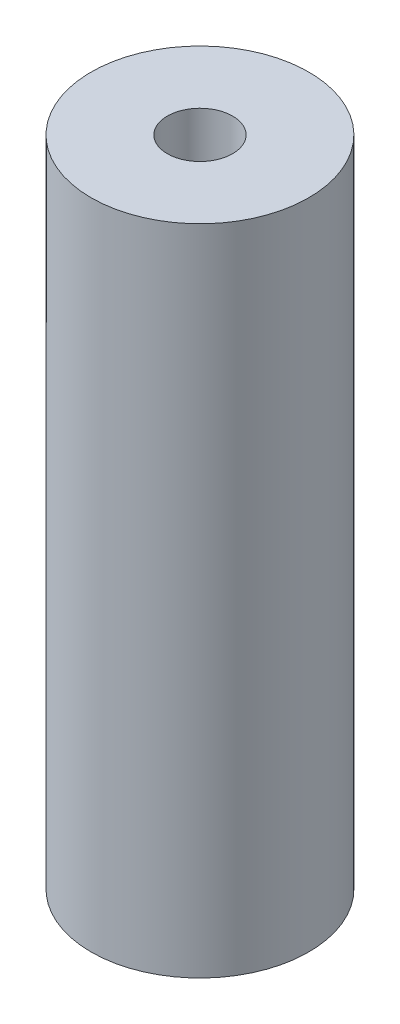
ISO-10303-21;
HEADER;
FILE_DESCRIPTION(('STEP AP214'),'2;1');
FILE_NAME('part.step','',(''),(''),'','','');
FILE_SCHEMA(('AUTOMOTIVE_DESIGN { 1 0 10303 214 1 1 1 1 }'));
ENDSEC;
DATA;
#1=APPLICATION_CONTEXT('core data for automotive mechanical design processes');
#2=APPLICATION_PROTOCOL_DEFINITION('international standard','automotive_design',2000,#1);
#3=PRODUCT_CONTEXT('',#1,'mechanical');
#4=PRODUCT('Part','Part','',(#3));
#5=PRODUCT_RELATED_PRODUCT_CATEGORY('part','',(#4));
#6=PRODUCT_DEFINITION_FORMATION('','',#4);
#7=PRODUCT_DEFINITION_CONTEXT('part definition',#1,'design');
#8=PRODUCT_DEFINITION('design','',#6,#7);
#9=PRODUCT_DEFINITION_SHAPE('','',#8);
#10=(LENGTH_UNIT() NAMED_UNIT(*) SI_UNIT(.MILLI.,.METRE.));
#11=(NAMED_UNIT(*) PLANE_ANGLE_UNIT() SI_UNIT($,.RADIAN.));
#12=(NAMED_UNIT(*) SI_UNIT($,.STERADIAN.) SOLID_ANGLE_UNIT());
#13=UNCERTAINTY_MEASURE_WITH_UNIT(LENGTH_MEASURE(1.E-05),#10,'distance_accuracy_value','');
#14=(GEOMETRIC_REPRESENTATION_CONTEXT(3) GLOBAL_UNCERTAINTY_ASSIGNED_CONTEXT((#13)) GLOBAL_UNIT_ASSIGNED_CONTEXT((#10,
#11,#12)) REPRESENTATION_CONTEXT('',''));
#15=CARTESIAN_POINT('',(0.,0.,0.));
#16=DIRECTION('',(0.,0.,1.));
#17=DIRECTION('',(1.,0.,0.));
#18=AXIS2_PLACEMENT_3D('',#15,#16,#17);
#19=CARTESIAN_POINT('',(0.,30.,0.));
#20=DIRECTION('',(0.,-1.,0.));
#21=DIRECTION('',(0.,0.,-1.));
#22=AXIS2_PLACEMENT_3D('',#19,#20,#21);
#23=CYLINDRICAL_SURFACE('',#22,5.);
#24=CARTESIAN_POINT('',(0.,30.,0.));
#25=DIRECTION('',(0.,1.,0.));
#26=DIRECTION('',(0.,0.,1.));
#27=AXIS2_PLACEMENT_3D('',#24,#25,#26);
#28=CIRCLE('',#27,5.);
#29=CARTESIAN_POINT('',(0.,30.,5.));
#30=VERTEX_POINT('',#29);
#31=EDGE_CURVE('E10',#30,#30,#28,.T.);
#32=ORIENTED_EDGE('',*,*,#31,.F.);
#33=EDGE_LOOP('',(#32));
#34=FACE_BOUND('',#33,.T.);
#35=CARTESIAN_POINT('',(0.,0.,0.));
#36=DIRECTION('',(0.,1.,0.));
#37=DIRECTION('',(0.,0.,1.));
#38=AXIS2_PLACEMENT_3D('',#35,#36,#37);
#39=CIRCLE('',#38,5.);
#40=CARTESIAN_POINT('',(0.,0.,5.));
#41=VERTEX_POINT('',#40);
#42=EDGE_CURVE('E34',#41,#41,#39,.T.);
#43=ORIENTED_EDGE('',*,*,#42,.T.);
#44=EDGE_LOOP('',(#43));
#45=FACE_BOUND('',#44,.T.);
#46=ADVANCED_FACE('F31',(#34,#45),#23,.T.);
#47=CARTESIAN_POINT('',(0.,30.,0.));
#48=DIRECTION('',(0.,1.,0.));
#49=DIRECTION('',(0.,0.,1.));
#50=AXIS2_PLACEMENT_3D('',#47,#48,#49);
#51=PLANE('',#50);
#52=CARTESIAN_POINT('',(0.,30.,0.));
#53=DIRECTION('',(0.,1.,0.));
#54=DIRECTION('',(0.,0.,1.));
#55=AXIS2_PLACEMENT_3D('',#52,#53,#54);
#56=CIRCLE('',#55,1.5);
#57=CARTESIAN_POINT('',(0.,30.,1.5));
#58=VERTEX_POINT('',#57);
#59=EDGE_CURVE('E43',#58,#58,#56,.T.);
#60=ORIENTED_EDGE('',*,*,#59,.F.);
#61=EDGE_LOOP('',(#60));
#62=FACE_BOUND('',#61,.T.);
#63=ORIENTED_EDGE('',*,*,#31,.T.);
#64=EDGE_LOOP('',(#63));
#65=FACE_BOUND('',#64,.T.);
#66=ADVANCED_FACE('F68',(#62,#65),#51,.T.);
#67=CARTESIAN_POINT('',(0.,0.,0.));
#68=DIRECTION('',(0.,1.,0.));
#69=DIRECTION('',(0.,0.,1.));
#70=AXIS2_PLACEMENT_3D('',#67,#68,#69);
#71=PLANE('',#70);
#72=CARTESIAN_POINT('',(0.,0.,0.));
#73=DIRECTION('',(0.,-1.,0.));
#74=DIRECTION('',(0.,0.,-1.));
#75=AXIS2_PLACEMENT_3D('',#72,#73,#74);
#76=CIRCLE('',#75,1.5);
#77=CARTESIAN_POINT('',(0.,0.,-1.5));
#78=VERTEX_POINT('',#77);
#79=EDGE_CURVE('E49',#78,#78,#76,.T.);
#80=ORIENTED_EDGE('',*,*,#79,.F.);
#81=EDGE_LOOP('',(#80));
#82=FACE_BOUND('',#81,.T.);
#83=ORIENTED_EDGE('',*,*,#42,.F.);
#84=EDGE_LOOP('',(#83));
#85=FACE_BOUND('',#84,.T.);
#86=ADVANCED_FACE('F64',(#82,#85),#71,.F.);
#87=CARTESIAN_POINT('',(0.,25.,0.));
#88=DIRECTION('',(0.,1.,0.));
#89=DIRECTION('',(0.,0.,1.));
#90=AXIS2_PLACEMENT_3D('',#87,#88,#89);
#91=CYLINDRICAL_SURFACE('',#90,1.5);
#92=CARTESIAN_POINT('',(0.,25.,0.));
#93=DIRECTION('',(0.,1.,0.));
#94=DIRECTION('',(0.,0.,1.));
#95=AXIS2_PLACEMENT_3D('',#92,#93,#94);
#96=CIRCLE('',#95,1.5);
#97=CARTESIAN_POINT('',(0.,25.,1.5));
#98=VERTEX_POINT('',#97);
#99=EDGE_CURVE('E41',#98,#98,#96,.T.);
#100=ORIENTED_EDGE('',*,*,#99,.F.);
#101=EDGE_LOOP('',(#100));
#102=FACE_BOUND('',#101,.T.);
#103=ORIENTED_EDGE('',*,*,#59,.T.);
#104=EDGE_LOOP('',(#103));
#105=FACE_BOUND('',#104,.T.);
#106=ADVANCED_FACE('F67',(#102,#105),#91,.F.);
#107=CARTESIAN_POINT('',(0.,25.,0.));
#108=DIRECTION('',(0.,1.,0.));
#109=DIRECTION('',(0.,0.,1.));
#110=AXIS2_PLACEMENT_3D('',#107,#108,#109);
#111=PLANE('',#110);
#112=ORIENTED_EDGE('',*,*,#99,.T.);
#113=EDGE_LOOP('',(#112));
#114=FACE_BOUND('',#113,.T.);
#115=ADVANCED_FACE('F60',(#114),#111,.T.);
#116=CARTESIAN_POINT('',(0.,5.,0.));
#117=DIRECTION('',(0.,-1.,0.));
#118=DIRECTION('',(0.,0.,-1.));
#119=AXIS2_PLACEMENT_3D('',#116,#117,#118);
#120=CYLINDRICAL_SURFACE('',#119,1.5);
#121=CARTESIAN_POINT('',(0.,5.,0.));
#122=DIRECTION('',(0.,-1.,0.));
#123=DIRECTION('',(0.,0.,-1.));
#124=AXIS2_PLACEMENT_3D('',#121,#122,#123);
#125=CIRCLE('',#124,1.5);
#126=CARTESIAN_POINT('',(0.,5.,-1.5));
#127=VERTEX_POINT('',#126);
#128=EDGE_CURVE('E46',#127,#127,#125,.T.);
#129=ORIENTED_EDGE('',*,*,#128,.F.);
#130=EDGE_LOOP('',(#129));
#131=FACE_BOUND('',#130,.T.);
#132=ORIENTED_EDGE('',*,*,#79,.T.);
#133=EDGE_LOOP('',(#132));
#134=FACE_BOUND('',#133,.T.);
#135=ADVANCED_FACE('F57',(#131,#134),#120,.F.);
#136=CARTESIAN_POINT('',(0.,5.,0.));
#137=DIRECTION('',(0.,-1.,0.));
#138=DIRECTION('',(0.,0.,-1.));
#139=AXIS2_PLACEMENT_3D('',#136,#137,#138);
#140=PLANE('',#139);
#141=ORIENTED_EDGE('',*,*,#128,.T.);
#142=EDGE_LOOP('',(#141));
#143=FACE_BOUND('',#142,.T.);
#144=ADVANCED_FACE('F55',(#143),#140,.T.);
#145=CLOSED_SHELL('',(#46,#66,#86,#106,#115,#135,#144));
#146=MANIFOLD_SOLID_BREP('B2',#145);
#147=ADVANCED_BREP_SHAPE_REPRESENTATION('',(#18,#146),#14);
#148=SHAPE_DEFINITION_REPRESENTATION(#9,#147);
ENDSEC;
END-ISO-10303-21;
